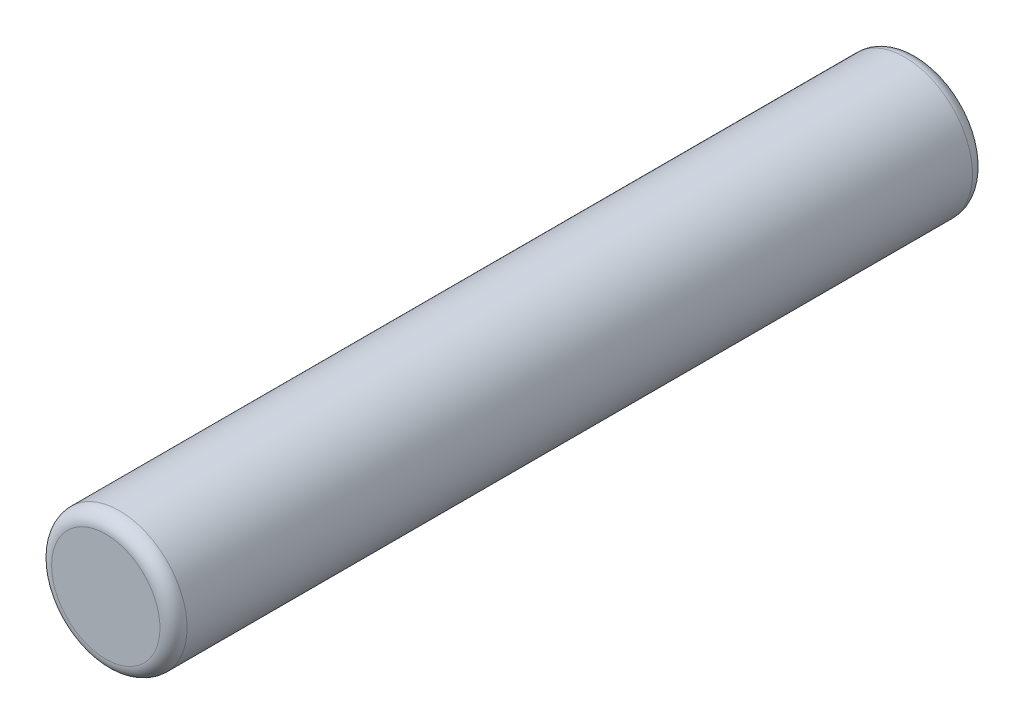
ISO-10303-21;
HEADER;
FILE_DESCRIPTION(('STEP AP214'),'2;1');
FILE_NAME('part.step','',(''),(''),'','','');
FILE_SCHEMA(('AUTOMOTIVE_DESIGN { 1 0 10303 214 1 1 1 1 }'));
ENDSEC;
DATA;
#1=APPLICATION_CONTEXT('core data for automotive mechanical design processes');
#2=APPLICATION_PROTOCOL_DEFINITION('international standard','automotive_design',2000,#1);
#3=PRODUCT_CONTEXT('',#1,'mechanical');
#4=PRODUCT('Part','Part','',(#3));
#5=PRODUCT_RELATED_PRODUCT_CATEGORY('part','',(#4));
#6=PRODUCT_DEFINITION_FORMATION('','',#4);
#7=PRODUCT_DEFINITION_CONTEXT('part definition',#1,'design');
#8=PRODUCT_DEFINITION('design','',#6,#7);
#9=PRODUCT_DEFINITION_SHAPE('','',#8);
#10=(LENGTH_UNIT() NAMED_UNIT(*) SI_UNIT(.MILLI.,.METRE.));
#11=(NAMED_UNIT(*) PLANE_ANGLE_UNIT() SI_UNIT($,.RADIAN.));
#12=(NAMED_UNIT(*) SI_UNIT($,.STERADIAN.) SOLID_ANGLE_UNIT());
#13=UNCERTAINTY_MEASURE_WITH_UNIT(LENGTH_MEASURE(1.E-05),#10,'distance_accuracy_value','');
#14=(GEOMETRIC_REPRESENTATION_CONTEXT(3) GLOBAL_UNCERTAINTY_ASSIGNED_CONTEXT((#13)) GLOBAL_UNIT_ASSIGNED_CONTEXT((#10,
#11,#12)) REPRESENTATION_CONTEXT('',''));
#15=CARTESIAN_POINT('',(0.,0.,0.));
#16=DIRECTION('',(0.,0.,1.));
#17=DIRECTION('',(1.,0.,0.));
#18=AXIS2_PLACEMENT_3D('',#15,#16,#17);
#19=CARTESIAN_POINT('',(0.,2.,3.));
#20=DIRECTION('',(0.,0.,1.));
#21=DIRECTION('',(1.,0.,0.));
#22=AXIS2_PLACEMENT_3D('',#19,#20,#21);
#23=PLANE('',#22);
#24=CARTESIAN_POINT('',(0.,2.,3.));
#25=DIRECTION('',(0.,0.,-1.));
#26=DIRECTION('',(-1.,0.,0.));
#27=AXIS2_PLACEMENT_3D('',#24,#25,#26);
#28=CIRCLE('',#27,0.4);
#29=CARTESIAN_POINT('',(-0.4,2.,3.));
#30=VERTEX_POINT('',#29);
#31=EDGE_CURVE('E62',#30,#30,#28,.T.);
#32=ORIENTED_EDGE('',*,*,#31,.F.);
#33=EDGE_LOOP('',(#32));
#34=FACE_BOUND('',#33,.T.);
#35=ADVANCED_FACE('F15',(#34),#23,.T.);
#36=CARTESIAN_POINT('',(0.,2.,-3.));
#37=DIRECTION('',(0.,0.,1.));
#38=DIRECTION('',(1.,0.,0.));
#39=AXIS2_PLACEMENT_3D('',#36,#37,#38);
#40=PLANE('',#39);
#41=CARTESIAN_POINT('',(0.,2.,-3.));
#42=DIRECTION('',(0.,0.,1.));
#43=DIRECTION('',(-1.,0.,0.));
#44=AXIS2_PLACEMENT_3D('',#41,#42,#43);
#45=CIRCLE('',#44,0.4);
#46=CARTESIAN_POINT('',(-0.4,2.,-3.));
#47=VERTEX_POINT('',#46);
#48=EDGE_CURVE('E30',#47,#47,#45,.T.);
#49=ORIENTED_EDGE('',*,*,#48,.F.);
#50=EDGE_LOOP('',(#49));
#51=FACE_BOUND('',#50,.T.);
#52=ADVANCED_FACE('F75',(#51),#40,.F.);
#53=CARTESIAN_POINT('',(0.,2.,2.9));
#54=DIRECTION('',(0.,0.,-1.));
#55=DIRECTION('',(1.,0.,0.));
#56=AXIS2_PLACEMENT_3D('',#53,#54,#55);
#57=TOROIDAL_SURFACE('',#56,0.4,0.1);
#58=ORIENTED_EDGE('',*,*,#31,.T.);
#59=EDGE_LOOP('',(#58));
#60=FACE_BOUND('',#59,.T.);
#61=CARTESIAN_POINT('',(0.,2.,2.9));
#62=DIRECTION('',(0.,0.,-1.));
#63=DIRECTION('',(-1.,0.,0.));
#64=AXIS2_PLACEMENT_3D('',#61,#62,#63);
#65=CIRCLE('',#64,0.5);
#66=CARTESIAN_POINT('',(-0.5,2.,2.9));
#67=VERTEX_POINT('',#66);
#68=EDGE_CURVE('E25',#67,#67,#65,.T.);
#69=ORIENTED_EDGE('',*,*,#68,.F.);
#70=EDGE_LOOP('',(#69));
#71=FACE_BOUND('',#70,.T.);
#72=ADVANCED_FACE('F43',(#60,#71),#57,.T.);
#73=CARTESIAN_POINT('',(0.,2.,-2.9));
#74=DIRECTION('',(0.,0.,-1.));
#75=DIRECTION('',(1.,0.,0.));
#76=AXIS2_PLACEMENT_3D('',#73,#74,#75);
#77=TOROIDAL_SURFACE('',#76,0.4,0.1);
#78=CARTESIAN_POINT('',(0.,2.,-2.9));
#79=DIRECTION('',(0.,0.,-1.));
#80=DIRECTION('',(-1.,0.,0.));
#81=AXIS2_PLACEMENT_3D('',#78,#79,#80);
#82=CIRCLE('',#81,0.5);
#83=CARTESIAN_POINT('',(-0.5,2.,-2.9));
#84=VERTEX_POINT('',#83);
#85=EDGE_CURVE('E10',#84,#84,#82,.F.);
#86=ORIENTED_EDGE('',*,*,#85,.F.);
#87=EDGE_LOOP('',(#86));
#88=FACE_BOUND('',#87,.T.);
#89=ORIENTED_EDGE('',*,*,#48,.T.);
#90=EDGE_LOOP('',(#89));
#91=FACE_BOUND('',#90,.T.);
#92=ADVANCED_FACE('F38',(#88,#91),#77,.T.);
#93=CARTESIAN_POINT('',(0.,2.,-3.));
#94=DIRECTION('',(0.,0.,-1.));
#95=DIRECTION('',(-1.,0.,0.));
#96=AXIS2_PLACEMENT_3D('',#93,#94,#95);
#97=CYLINDRICAL_SURFACE('',#96,0.5);
#98=ORIENTED_EDGE('',*,*,#85,.T.);
#99=EDGE_LOOP('',(#98));
#100=FACE_BOUND('',#99,.T.);
#101=ORIENTED_EDGE('',*,*,#68,.T.);
#102=EDGE_LOOP('',(#101));
#103=FACE_BOUND('',#102,.T.);
#104=ADVANCED_FACE('F42',(#100,#103),#97,.T.);
#105=CLOSED_SHELL('',(#35,#52,#72,#92,#104));
#106=MANIFOLD_SOLID_BREP('B1',#105);
#107=ADVANCED_BREP_SHAPE_REPRESENTATION('',(#18,#106),#14);
#108=SHAPE_DEFINITION_REPRESENTATION(#9,#107);
ENDSEC;
END-ISO-10303-21;
